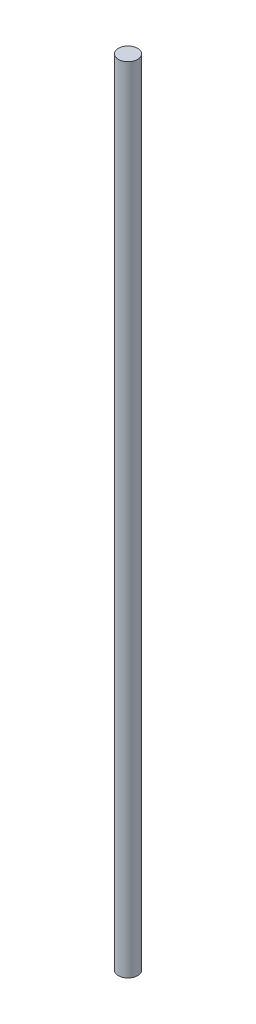
ISO-10303-21;
HEADER;
FILE_DESCRIPTION(('STEP AP214'),'2;1');
FILE_NAME('part.step','',(''),(''),'','','');
FILE_SCHEMA(('AUTOMOTIVE_DESIGN { 1 0 10303 214 1 1 1 1 }'));
ENDSEC;
DATA;
#1=APPLICATION_CONTEXT('core data for automotive mechanical design processes');
#2=APPLICATION_PROTOCOL_DEFINITION('international standard','automotive_design',2000,#1);
#3=PRODUCT_CONTEXT('',#1,'mechanical');
#4=PRODUCT('Part','Part','',(#3));
#5=PRODUCT_RELATED_PRODUCT_CATEGORY('part','',(#4));
#6=PRODUCT_DEFINITION_FORMATION('','',#4);
#7=PRODUCT_DEFINITION_CONTEXT('part definition',#1,'design');
#8=PRODUCT_DEFINITION('design','',#6,#7);
#9=PRODUCT_DEFINITION_SHAPE('','',#8);
#10=(LENGTH_UNIT() NAMED_UNIT(*) SI_UNIT(.MILLI.,.METRE.));
#11=(NAMED_UNIT(*) PLANE_ANGLE_UNIT() SI_UNIT($,.RADIAN.));
#12=(NAMED_UNIT(*) SI_UNIT($,.STERADIAN.) SOLID_ANGLE_UNIT());
#13=UNCERTAINTY_MEASURE_WITH_UNIT(LENGTH_MEASURE(1.E-05),#10,'distance_accuracy_value','');
#14=(GEOMETRIC_REPRESENTATION_CONTEXT(3) GLOBAL_UNCERTAINTY_ASSIGNED_CONTEXT((#13)) GLOBAL_UNIT_ASSIGNED_CONTEXT((#10,
#11,#12)) REPRESENTATION_CONTEXT('',''));
#15=CARTESIAN_POINT('',(0.,0.,0.));
#16=DIRECTION('',(0.,0.,1.));
#17=DIRECTION('',(1.,0.,0.));
#18=AXIS2_PLACEMENT_3D('',#15,#16,#17);
#19=CARTESIAN_POINT('',(100.,-330.,0.));
#20=DIRECTION('',(0.,1.,0.));
#21=DIRECTION('',(0.,0.,1.));
#22=AXIS2_PLACEMENT_3D('',#19,#20,#21);
#23=CYLINDRICAL_SURFACE('',#22,4.);
#24=CARTESIAN_POINT('',(100.,-330.,0.));
#25=DIRECTION('',(0.,1.,0.));
#26=DIRECTION('',(0.,0.,1.));
#27=AXIS2_PLACEMENT_3D('',#24,#25,#26);
#28=CIRCLE('',#27,4.);
#29=CARTESIAN_POINT('',(100.,-330.,4.));
#30=VERTEX_POINT('',#29);
#31=EDGE_CURVE('E10',#30,#30,#28,.T.);
#32=ORIENTED_EDGE('',*,*,#31,.T.);
#33=EDGE_LOOP('',(#32));
#34=FACE_BOUND('',#33,.T.);
#35=CARTESIAN_POINT('',(100.,0.,0.));
#36=DIRECTION('',(0.,1.,0.));
#37=DIRECTION('',(0.,0.,1.));
#38=AXIS2_PLACEMENT_3D('',#35,#36,#37);
#39=CIRCLE('',#38,4.);
#40=CARTESIAN_POINT('',(100.,0.,4.));
#41=VERTEX_POINT('',#40);
#42=EDGE_CURVE('E37',#41,#41,#39,.T.);
#43=ORIENTED_EDGE('',*,*,#42,.F.);
#44=EDGE_LOOP('',(#43));
#45=FACE_BOUND('',#44,.T.);
#46=ADVANCED_FACE('F31',(#34,#45),#23,.T.);
#47=CARTESIAN_POINT('',(104.,-330.,0.));
#48=DIRECTION('',(0.,-1.,0.));
#49=DIRECTION('',(0.,0.,-1.));
#50=AXIS2_PLACEMENT_3D('',#47,#48,#49);
#51=PLANE('',#50);
#52=ORIENTED_EDGE('',*,*,#31,.F.);
#53=EDGE_LOOP('',(#52));
#54=FACE_BOUND('',#53,.T.);
#55=ADVANCED_FACE('F46',(#54),#51,.T.);
#56=CARTESIAN_POINT('',(100.,0.,0.));
#57=DIRECTION('',(0.,1.,0.));
#58=DIRECTION('',(0.,0.,1.));
#59=AXIS2_PLACEMENT_3D('',#56,#57,#58);
#60=PLANE('',#59);
#61=ORIENTED_EDGE('',*,*,#42,.T.);
#62=EDGE_LOOP('',(#61));
#63=FACE_BOUND('',#62,.T.);
#64=ADVANCED_FACE('F43',(#63),#60,.T.);
#65=CLOSED_SHELL('',(#46,#55,#64));
#66=MANIFOLD_SOLID_BREP('B2',#65);
#67=ADVANCED_BREP_SHAPE_REPRESENTATION('',(#18,#66),#14);
#68=SHAPE_DEFINITION_REPRESENTATION(#9,#67);
ENDSEC;
END-ISO-10303-21;
